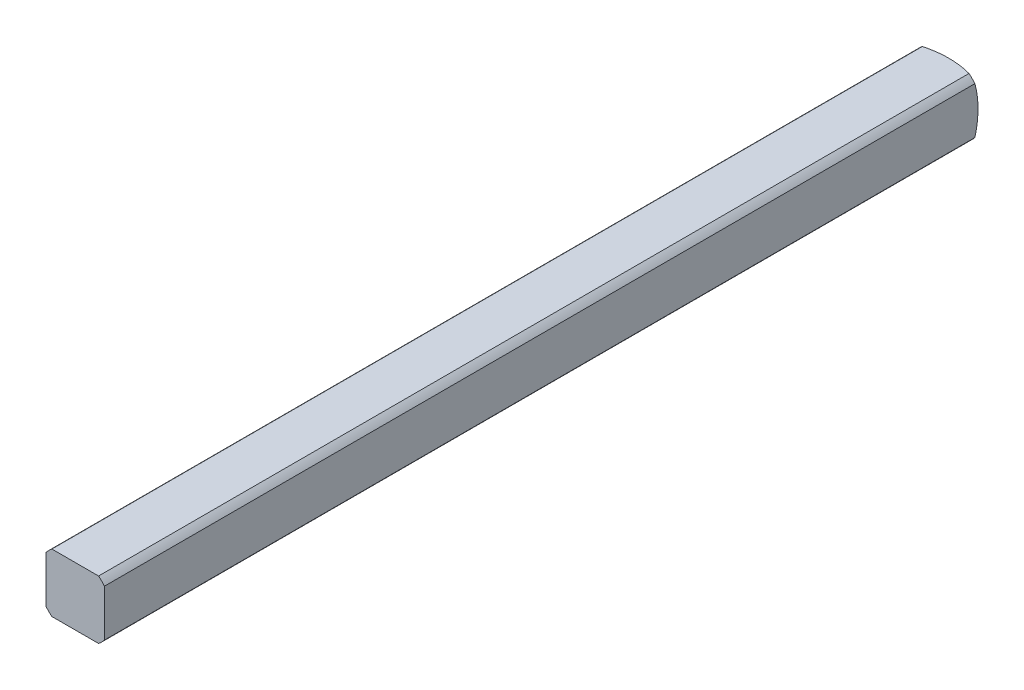
ISO-10303-21;
HEADER;
FILE_DESCRIPTION(('STEP AP214'),'2;1');
FILE_NAME('part.step','',(''),(''),'','','');
FILE_SCHEMA(('AUTOMOTIVE_DESIGN { 1 0 10303 214 1 1 1 1 }'));
ENDSEC;
DATA;
#1=APPLICATION_CONTEXT('core data for automotive mechanical design processes');
#2=APPLICATION_PROTOCOL_DEFINITION('international standard','automotive_design',2000,#1);
#3=PRODUCT_CONTEXT('',#1,'mechanical');
#4=PRODUCT('Part','Part','',(#3));
#5=PRODUCT_RELATED_PRODUCT_CATEGORY('part','',(#4));
#6=PRODUCT_DEFINITION_FORMATION('','',#4);
#7=PRODUCT_DEFINITION_CONTEXT('part definition',#1,'design');
#8=PRODUCT_DEFINITION('design','',#6,#7);
#9=PRODUCT_DEFINITION_SHAPE('','',#8);
#10=(LENGTH_UNIT() NAMED_UNIT(*) SI_UNIT(.MILLI.,.METRE.));
#11=(NAMED_UNIT(*) PLANE_ANGLE_UNIT() SI_UNIT($,.RADIAN.));
#12=(NAMED_UNIT(*) SI_UNIT($,.STERADIAN.) SOLID_ANGLE_UNIT());
#13=UNCERTAINTY_MEASURE_WITH_UNIT(LENGTH_MEASURE(1.E-05),#10,'distance_accuracy_value','');
#14=(GEOMETRIC_REPRESENTATION_CONTEXT(3) GLOBAL_UNCERTAINTY_ASSIGNED_CONTEXT((#13)) GLOBAL_UNIT_ASSIGNED_CONTEXT((#10,
#11,#12)) REPRESENTATION_CONTEXT('',''));
#15=CARTESIAN_POINT('',(0.,0.,0.));
#16=DIRECTION('',(0.,0.,1.));
#17=DIRECTION('',(1.,0.,0.));
#18=AXIS2_PLACEMENT_3D('',#15,#16,#17);
#19=CARTESIAN_POINT('',(-1.5875,-1.5875,25.4));
#20=DIRECTION('',(1.,0.,0.));
#21=DIRECTION('',(0.,0.,-1.));
#22=AXIS2_PLACEMENT_3D('',#19,#20,#21);
#23=PLANE('',#22);
#24=DIRECTION('',(0.,0.,-1.));
#25=VECTOR('',#24,1.);
#26=CARTESIAN_POINT('',(-1.5875,-1.26841150657032,25.4));
#27=LINE('',#26,#25);
#28=CARTESIAN_POINT('',(-1.5875,-1.26841150657032,47.5314599549966));
#29=VERTEX_POINT('',#28);
#30=CARTESIAN_POINT('',(-1.5875,-1.26841150657032,0.263225357686904));
#31=VERTEX_POINT('',#30);
#32=EDGE_CURVE('E138',#29,#31,#27,.T.);
#33=ORIENTED_EDGE('',*,*,#32,.F.);
#34=DIRECTION('',(0.,1.,0.));
#35=VECTOR('',#34,1.);
#36=CARTESIAN_POINT('',(-1.5875,-1.5875,47.5314599549966));
#37=LINE('',#36,#35);
#38=CARTESIAN_POINT('',(-1.5875,1.26841150657032,47.5314599549966));
#39=VERTEX_POINT('',#38);
#40=EDGE_CURVE('E117',#29,#39,#37,.T.);
#41=ORIENTED_EDGE('',*,*,#40,.T.);
#42=DIRECTION('',(0.,0.,-1.));
#43=VECTOR('',#42,1.);
#44=CARTESIAN_POINT('',(-1.5875,1.26841150657032,25.4));
#45=LINE('',#44,#43);
#46=CARTESIAN_POINT('',(-1.5875,1.26841150657032,0.263225357686903));
#47=VERTEX_POINT('',#46);
#48=EDGE_CURVE('E135',#47,#39,#45,.F.);
#49=ORIENTED_EDGE('',*,*,#48,.F.);
#50=CARTESIAN_POINT('',(-1.5875,0.,4.91912226376204));
#51=DIRECTION('',(1.,0.,0.));
#52=DIRECTION('',(0.,0.,-1.));
#53=AXIS2_PLACEMENT_3D('',#50,#51,#52);
#54=CIRCLE('',#53,4.82558221875869);
#55=EDGE_CURVE('E55',#31,#47,#54,.T.);
#56=ORIENTED_EDGE('',*,*,#55,.F.);
#57=EDGE_LOOP('',(#33,#41,#49,#56));
#58=FACE_BOUND('',#57,.T.);
#59=ADVANCED_FACE('F34',(#58),#23,.F.);
#60=CARTESIAN_POINT('',(-1.5875,-1.5875,25.4));
#61=DIRECTION('',(0.,1.,0.));
#62=DIRECTION('',(0.,0.,1.));
#63=AXIS2_PLACEMENT_3D('',#60,#61,#62);
#64=PLANE('',#63);
#65=DIRECTION('',(0.,0.,-1.));
#66=VECTOR('',#65,1.);
#67=CARTESIAN_POINT('',(1.26841150657032,-1.5875,25.4));
#68=LINE('',#67,#66);
#69=CARTESIAN_POINT('',(1.26841150657033,-1.5875,47.5314599549966));
#70=VERTEX_POINT('',#69);
#71=CARTESIAN_POINT('',(1.26841150657032,-1.5875,0.263225357686905));
#72=VERTEX_POINT('',#71);
#73=EDGE_CURVE('E133',#70,#72,#68,.T.);
#74=ORIENTED_EDGE('',*,*,#73,.F.);
#75=DIRECTION('',(1.,0.,0.));
#76=VECTOR('',#75,1.);
#77=CARTESIAN_POINT('',(-1.5875,-1.5875,47.5314599549966));
#78=LINE('',#77,#76);
#79=CARTESIAN_POINT('',(-1.26841150657033,-1.5875,47.5314599549966));
#80=VERTEX_POINT('',#79);
#81=EDGE_CURVE('E103',#80,#70,#78,.T.);
#82=ORIENTED_EDGE('',*,*,#81,.F.);
#83=DIRECTION('',(0.,0.,-1.));
#84=VECTOR('',#83,1.);
#85=CARTESIAN_POINT('',(-1.26841150657032,-1.5875,25.4));
#86=LINE('',#85,#84);
#87=CARTESIAN_POINT('',(-1.26841150657032,-1.5875,0.263225357686904));
#88=VERTEX_POINT('',#87);
#89=EDGE_CURVE('E125',#88,#80,#86,.F.);
#90=ORIENTED_EDGE('',*,*,#89,.F.);
#91=CARTESIAN_POINT('',(0.,-1.5875,4.91912226376204));
#92=DIRECTION('',(0.,1.,0.));
#93=DIRECTION('',(0.,0.,1.));
#94=AXIS2_PLACEMENT_3D('',#91,#92,#93);
#95=CIRCLE('',#94,4.82558221875869);
#96=EDGE_CURVE('E165',#72,#88,#95,.T.);
#97=ORIENTED_EDGE('',*,*,#96,.F.);
#98=EDGE_LOOP('',(#74,#82,#90,#97));
#99=FACE_BOUND('',#98,.T.);
#100=ADVANCED_FACE('F181',(#99),#64,.F.);
#101=CARTESIAN_POINT('',(1.5875,-1.5875,25.4));
#102=DIRECTION('',(-1.,0.,0.));
#103=DIRECTION('',(0.,0.,1.));
#104=AXIS2_PLACEMENT_3D('',#101,#102,#103);
#105=PLANE('',#104);
#106=DIRECTION('',(0.,0.,-1.));
#107=VECTOR('',#106,1.);
#108=CARTESIAN_POINT('',(1.5875,1.26841150657032,25.4));
#109=LINE('',#108,#107);
#110=CARTESIAN_POINT('',(1.5875,1.26841150657032,47.5314599549966));
#111=VERTEX_POINT('',#110);
#112=CARTESIAN_POINT('',(1.5875,1.26841150657032,0.263225357686904));
#113=VERTEX_POINT('',#112);
#114=EDGE_CURVE('E116',#111,#113,#109,.T.);
#115=ORIENTED_EDGE('',*,*,#114,.F.);
#116=DIRECTION('',(0.,1.,0.));
#117=VECTOR('',#116,1.);
#118=CARTESIAN_POINT('',(1.5875,-1.5875,47.5314599549966));
#119=LINE('',#118,#117);
#120=CARTESIAN_POINT('',(1.5875,-1.26841150657032,47.5314599549966));
#121=VERTEX_POINT('',#120);
#122=EDGE_CURVE('E100',#121,#111,#119,.T.);
#123=ORIENTED_EDGE('',*,*,#122,.F.);
#124=DIRECTION('',(0.,0.,-1.));
#125=VECTOR('',#124,1.);
#126=CARTESIAN_POINT('',(1.5875,-1.26841150657032,25.4));
#127=LINE('',#126,#125);
#128=CARTESIAN_POINT('',(1.5875,-1.26841150657032,0.263225357686904));
#129=VERTEX_POINT('',#128);
#130=EDGE_CURVE('E115',#129,#121,#127,.F.);
#131=ORIENTED_EDGE('',*,*,#130,.F.);
#132=CARTESIAN_POINT('',(1.5875,0.,4.91912226376204));
#133=DIRECTION('',(-1.,0.,0.));
#134=DIRECTION('',(0.,0.,1.));
#135=AXIS2_PLACEMENT_3D('',#132,#133,#134);
#136=CIRCLE('',#135,4.82558221875869);
#137=EDGE_CURVE('E163',#113,#129,#136,.T.);
#138=ORIENTED_EDGE('',*,*,#137,.F.);
#139=EDGE_LOOP('',(#115,#123,#131,#138));
#140=FACE_BOUND('',#139,.T.);
#141=ADVANCED_FACE('F113',(#140),#105,.F.);
#142=CARTESIAN_POINT('',(-1.5875,1.5875,25.4));
#143=DIRECTION('',(0.,-1.,0.));
#144=DIRECTION('',(0.,0.,-1.));
#145=AXIS2_PLACEMENT_3D('',#142,#143,#144);
#146=PLANE('',#145);
#147=DIRECTION('',(0.,0.,-1.));
#148=VECTOR('',#147,1.);
#149=CARTESIAN_POINT('',(-1.26841150657032,1.5875,25.4));
#150=LINE('',#149,#148);
#151=CARTESIAN_POINT('',(-1.26841150657032,1.5875,47.5314599549966));
#152=VERTEX_POINT('',#151);
#153=CARTESIAN_POINT('',(-1.26841150657032,1.5875,0.263225357686904));
#154=VERTEX_POINT('',#153);
#155=EDGE_CURVE('E123',#152,#154,#150,.T.);
#156=ORIENTED_EDGE('',*,*,#155,.F.);
#157=DIRECTION('',(1.,0.,0.));
#158=VECTOR('',#157,1.);
#159=CARTESIAN_POINT('',(-1.5875,1.5875,47.5314599549966));
#160=LINE('',#159,#158);
#161=CARTESIAN_POINT('',(1.26841150657032,1.5875,47.5314599549966));
#162=VERTEX_POINT('',#161);
#163=EDGE_CURVE('E47',#152,#162,#160,.T.);
#164=ORIENTED_EDGE('',*,*,#163,.T.);
#165=DIRECTION('',(0.,0.,-1.));
#166=VECTOR('',#165,1.);
#167=CARTESIAN_POINT('',(1.26841150657032,1.5875,25.4));
#168=LINE('',#167,#166);
#169=CARTESIAN_POINT('',(1.26841150657032,1.5875,0.263225357686904));
#170=VERTEX_POINT('',#169);
#171=EDGE_CURVE('E127',#170,#162,#168,.F.);
#172=ORIENTED_EDGE('',*,*,#171,.F.);
#173=CARTESIAN_POINT('',(0.,1.5875,4.91912226376204));
#174=DIRECTION('',(0.,-1.,0.));
#175=DIRECTION('',(0.,0.,-1.));
#176=AXIS2_PLACEMENT_3D('',#173,#174,#175);
#177=CIRCLE('',#176,4.82558221875869);
#178=EDGE_CURVE('E154',#154,#170,#177,.T.);
#179=ORIENTED_EDGE('',*,*,#178,.F.);
#180=EDGE_LOOP('',(#156,#164,#172,#179));
#181=FACE_BOUND('',#180,.T.);
#182=ADVANCED_FACE('F176',(#181),#146,.F.);
#183=CARTESIAN_POINT('',(0.,0.,25.4));
#184=DIRECTION('',(0.,0.,-1.));
#185=DIRECTION('',(-1.,0.,0.));
#186=AXIS2_PLACEMENT_3D('',#183,#184,#185);
#187=CYLINDRICAL_SURFACE('',#186,2.032);
#188=CARTESIAN_POINT('',(0.,0.,47.5314599549966));
#189=DIRECTION('',(0.,0.,-1.));
#190=DIRECTION('',(-1.,0.,0.));
#191=AXIS2_PLACEMENT_3D('',#188,#189,#190);
#192=CIRCLE('',#191,2.032);
#193=EDGE_CURVE('E107',#29,#80,#192,.F.);
#194=ORIENTED_EDGE('',*,*,#193,.F.);
#195=ORIENTED_EDGE('',*,*,#32,.T.);
#196=CARTESIAN_POINT('',(0.,0.,0.263225357686904));
#197=DIRECTION('',(0.,0.,1.));
#198=DIRECTION('',(1.,0.,0.));
#199=AXIS2_PLACEMENT_3D('',#196,#197,#198);
#200=CIRCLE('',#199,2.032);
#201=EDGE_CURVE('E160',#31,#88,#200,.T.);
#202=ORIENTED_EDGE('',*,*,#201,.T.);
#203=ORIENTED_EDGE('',*,*,#89,.T.);
#204=EDGE_LOOP('',(#194,#195,#202,#203));
#205=FACE_BOUND('',#204,.T.);
#206=ADVANCED_FACE('F183',(#205),#187,.T.);
#207=CARTESIAN_POINT('',(0.,0.,47.5314599549966));
#208=DIRECTION('',(0.,0.,-1.));
#209=DIRECTION('',(-1.,0.,0.));
#210=AXIS2_PLACEMENT_3D('',#207,#208,#209);
#211=CIRCLE('',#210,2.032);
#212=EDGE_CURVE('E97',#70,#121,#211,.F.);
#213=ORIENTED_EDGE('',*,*,#212,.F.);
#214=ORIENTED_EDGE('',*,*,#73,.T.);
#215=CARTESIAN_POINT('',(0.,0.,0.263225357686904));
#216=DIRECTION('',(0.,0.,1.));
#217=DIRECTION('',(1.,0.,0.));
#218=AXIS2_PLACEMENT_3D('',#215,#216,#217);
#219=CIRCLE('',#218,2.032);
#220=EDGE_CURVE('E122',#72,#129,#219,.T.);
#221=ORIENTED_EDGE('',*,*,#220,.T.);
#222=ORIENTED_EDGE('',*,*,#130,.T.);
#223=EDGE_LOOP('',(#213,#214,#221,#222));
#224=FACE_BOUND('',#223,.T.);
#225=ADVANCED_FACE('F120',(#224),#187,.T.);
#226=CARTESIAN_POINT('',(0.,0.,47.5314599549966));
#227=DIRECTION('',(0.,0.,-1.));
#228=DIRECTION('',(-1.,0.,0.));
#229=AXIS2_PLACEMENT_3D('',#226,#227,#228);
#230=CIRCLE('',#229,2.032);
#231=EDGE_CURVE('E108',#111,#162,#230,.F.);
#232=ORIENTED_EDGE('',*,*,#231,.F.);
#233=ORIENTED_EDGE('',*,*,#114,.T.);
#234=CARTESIAN_POINT('',(0.,0.,0.263225357686904));
#235=DIRECTION('',(0.,0.,1.));
#236=DIRECTION('',(1.,0.,0.));
#237=AXIS2_PLACEMENT_3D('',#234,#235,#236);
#238=CIRCLE('',#237,2.032);
#239=EDGE_CURVE('E157',#113,#170,#238,.T.);
#240=ORIENTED_EDGE('',*,*,#239,.T.);
#241=ORIENTED_EDGE('',*,*,#171,.T.);
#242=EDGE_LOOP('',(#232,#233,#240,#241));
#243=FACE_BOUND('',#242,.T.);
#244=ADVANCED_FACE('F173',(#243),#187,.T.);
#245=CARTESIAN_POINT('',(0.,0.,47.5314599549966));
#246=DIRECTION('',(0.,0.,-1.));
#247=DIRECTION('',(-1.,0.,0.));
#248=AXIS2_PLACEMENT_3D('',#245,#246,#247);
#249=CIRCLE('',#248,2.032);
#250=EDGE_CURVE('E12',#152,#39,#249,.F.);
#251=ORIENTED_EDGE('',*,*,#250,.F.);
#252=ORIENTED_EDGE('',*,*,#155,.T.);
#253=CARTESIAN_POINT('',(0.,0.,0.263225357686904));
#254=DIRECTION('',(0.,0.,1.));
#255=DIRECTION('',(1.,0.,0.));
#256=AXIS2_PLACEMENT_3D('',#253,#254,#255);
#257=CIRCLE('',#256,2.032);
#258=EDGE_CURVE('E41',#154,#47,#257,.T.);
#259=ORIENTED_EDGE('',*,*,#258,.T.);
#260=ORIENTED_EDGE('',*,*,#48,.T.);
#261=EDGE_LOOP('',(#251,#252,#259,#260));
#262=FACE_BOUND('',#261,.T.);
#263=ADVANCED_FACE('F141',(#262),#187,.T.);
#264=CARTESIAN_POINT('',(0.,0.,4.91912226376204));
#265=DIRECTION('',(0.,0.,1.));
#266=DIRECTION('',(-1.,0.,0.));
#267=AXIS2_PLACEMENT_3D('',#264,#265,#266);
#268=SPHERICAL_SURFACE('',#267,5.08);
#269=CARTESIAN_POINT('',(0.,0.,0.));
#270=DIRECTION('',(0.,0.,-1.));
#271=DIRECTION('',(-1.,0.,0.));
#272=AXIS2_PLACEMENT_3D('',#269,#270,#271);
#273=CIRCLE('',#272,1.26832020963187);
#274=CARTESIAN_POINT('',(-1.26832020963187,0.,0.));
#275=VERTEX_POINT('',#274);
#276=EDGE_CURVE('E168',#275,#275,#273,.T.);
#277=ORIENTED_EDGE('',*,*,#276,.F.);
#278=EDGE_LOOP('',(#277));
#279=FACE_BOUND('',#278,.T.);
#280=ORIENTED_EDGE('',*,*,#96,.T.);
#281=ORIENTED_EDGE('',*,*,#201,.F.);
#282=ORIENTED_EDGE('',*,*,#55,.T.);
#283=ORIENTED_EDGE('',*,*,#258,.F.);
#284=ORIENTED_EDGE('',*,*,#178,.T.);
#285=ORIENTED_EDGE('',*,*,#239,.F.);
#286=ORIENTED_EDGE('',*,*,#137,.T.);
#287=ORIENTED_EDGE('',*,*,#220,.F.);
#288=EDGE_LOOP('',(#280,#281,#282,#283,#284,#285,#286,#287));
#289=FACE_BOUND('',#288,.T.);
#290=ADVANCED_FACE('F177',(#279,#289),#268,.T.);
#291=CARTESIAN_POINT('',(0.,0.,0.));
#292=DIRECTION('',(0.,0.,-1.));
#293=DIRECTION('',(-1.,0.,0.));
#294=AXIS2_PLACEMENT_3D('',#291,#292,#293);
#295=PLANE('',#294);
#296=ORIENTED_EDGE('',*,*,#276,.T.);
#297=EDGE_LOOP('',(#296));
#298=FACE_BOUND('',#297,.T.);
#299=ADVANCED_FACE('F202',(#298),#295,.T.);
#300=CARTESIAN_POINT('',(-1.5875,-1.5875,47.5314599549966));
#301=DIRECTION('',(0.,0.,-1.));
#302=DIRECTION('',(-1.,0.,0.));
#303=AXIS2_PLACEMENT_3D('',#300,#301,#302);
#304=PLANE('',#303);
#305=ORIENTED_EDGE('',*,*,#193,.T.);
#306=ORIENTED_EDGE('',*,*,#81,.T.);
#307=ORIENTED_EDGE('',*,*,#212,.T.);
#308=ORIENTED_EDGE('',*,*,#122,.T.);
#309=ORIENTED_EDGE('',*,*,#231,.T.);
#310=ORIENTED_EDGE('',*,*,#163,.F.);
#311=ORIENTED_EDGE('',*,*,#250,.T.);
#312=ORIENTED_EDGE('',*,*,#40,.F.);
#313=EDGE_LOOP('',(#305,#306,#307,#308,#309,#310,#311,#312));
#314=FACE_BOUND('',#313,.T.);
#315=ADVANCED_FACE('F99',(#314),#304,.F.);
#316=CLOSED_SHELL('',(#59,#100,#141,#182,#206,#225,#244,#263,#290,#299,#315));
#317=MANIFOLD_SOLID_BREP('B2',#316);
#318=ADVANCED_BREP_SHAPE_REPRESENTATION('',(#18,#317),#14);
#319=SHAPE_DEFINITION_REPRESENTATION(#9,#318);
ENDSEC;
END-ISO-10303-21;
